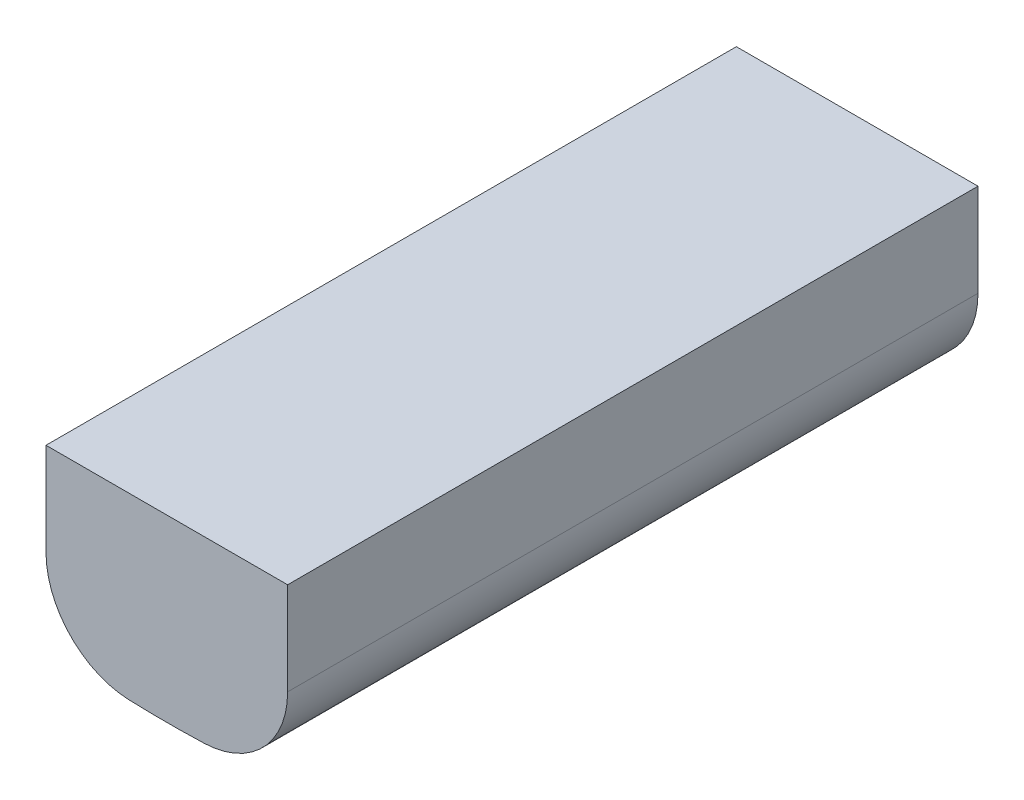
ISO-10303-21;
HEADER;
FILE_DESCRIPTION(('STEP AP214'),'2;1');
FILE_NAME('part.step','',(''),(''),'','','');
FILE_SCHEMA(('AUTOMOTIVE_DESIGN { 1 0 10303 214 1 1 1 1 }'));
ENDSEC;
DATA;
#1=APPLICATION_CONTEXT('core data for automotive mechanical design processes');
#2=APPLICATION_PROTOCOL_DEFINITION('international standard','automotive_design',2000,#1);
#3=PRODUCT_CONTEXT('',#1,'mechanical');
#4=PRODUCT('Part','Part','',(#3));
#5=PRODUCT_RELATED_PRODUCT_CATEGORY('part','',(#4));
#6=PRODUCT_DEFINITION_FORMATION('','',#4);
#7=PRODUCT_DEFINITION_CONTEXT('part definition',#1,'design');
#8=PRODUCT_DEFINITION('design','',#6,#7);
#9=PRODUCT_DEFINITION_SHAPE('','',#8);
#10=(LENGTH_UNIT() NAMED_UNIT(*) SI_UNIT(.MILLI.,.METRE.));
#11=(NAMED_UNIT(*) PLANE_ANGLE_UNIT() SI_UNIT($,.RADIAN.));
#12=(NAMED_UNIT(*) SI_UNIT($,.STERADIAN.) SOLID_ANGLE_UNIT());
#13=UNCERTAINTY_MEASURE_WITH_UNIT(LENGTH_MEASURE(1.E-05),#10,'distance_accuracy_value','');
#14=(GEOMETRIC_REPRESENTATION_CONTEXT(3) GLOBAL_UNCERTAINTY_ASSIGNED_CONTEXT((#13)) GLOBAL_UNIT_ASSIGNED_CONTEXT((#10,
#11,#12)) REPRESENTATION_CONTEXT('',''));
#15=CARTESIAN_POINT('',(0.,0.,0.));
#16=DIRECTION('',(0.,0.,1.));
#17=DIRECTION('',(1.,0.,0.));
#18=AXIS2_PLACEMENT_3D('',#15,#16,#17);
#19=CARTESIAN_POINT('',(0.05,-1.37409060836613,1.));
#20=DIRECTION('',(0.,0.,-1.));
#21=DIRECTION('',(-1.,0.,0.));
#22=AXIS2_PLACEMENT_3D('',#19,#20,#21);
#23=CYLINDRICAL_SURFACE('',#22,0.125);
#24=CARTESIAN_POINT('',(0.05,-1.37409060836613,0.));
#25=DIRECTION('',(0.,0.,1.));
#26=DIRECTION('',(-1.,0.,0.));
#27=AXIS2_PLACEMENT_3D('',#24,#25,#26);
#28=CIRCLE('',#27,0.125);
#29=CARTESIAN_POINT('',(0.0545454545454544,-1.49900793639941,0.));
#30=VERTEX_POINT('',#29);
#31=CARTESIAN_POINT('',(0.175,-1.37409060836613,0.));
#32=VERTEX_POINT('',#31);
#33=EDGE_CURVE('E121',#30,#32,#28,.T.);
#34=ORIENTED_EDGE('',*,*,#33,.T.);
#35=DIRECTION('',(0.,0.,-1.));
#36=VECTOR('',#35,1.);
#37=CARTESIAN_POINT('',(0.175,-1.37409060836613,1.));
#38=LINE('',#37,#36);
#39=CARTESIAN_POINT('',(0.175,-1.37409060836613,1.));
#40=VERTEX_POINT('',#39);
#41=EDGE_CURVE('E11',#40,#32,#38,.T.);
#42=ORIENTED_EDGE('',*,*,#41,.F.);
#43=CARTESIAN_POINT('',(0.05,-1.37409060836613,1.));
#44=DIRECTION('',(0.,0.,1.));
#45=DIRECTION('',(-1.,0.,0.));
#46=AXIS2_PLACEMENT_3D('',#43,#44,#45);
#47=CIRCLE('',#46,0.125);
#48=CARTESIAN_POINT('',(0.0545454545454544,-1.49900793639941,1.));
#49=VERTEX_POINT('',#48);
#50=EDGE_CURVE('E131',#49,#40,#47,.T.);
#51=ORIENTED_EDGE('',*,*,#50,.F.);
#52=DIRECTION('',(0.,0.,-1.));
#53=VECTOR('',#52,1.);
#54=CARTESIAN_POINT('',(0.0545454545454544,-1.49900793639941,1.));
#55=LINE('',#54,#53);
#56=EDGE_CURVE('E117',#49,#30,#55,.T.);
#57=ORIENTED_EDGE('',*,*,#56,.T.);
#58=EDGE_LOOP('',(#34,#42,#51,#57));
#59=FACE_BOUND('',#58,.T.);
#60=ADVANCED_FACE('F37',(#59),#23,.T.);
#61=CARTESIAN_POINT('',(0.175,-1.23975669154396,1.));
#62=DIRECTION('',(-1.,0.,0.));
#63=DIRECTION('',(0.,-1.,0.));
#64=AXIS2_PLACEMENT_3D('',#61,#62,#63);
#65=PLANE('',#64);
#66=DIRECTION('',(0.,1.,0.));
#67=VECTOR('',#66,1.);
#68=CARTESIAN_POINT('',(0.175,-1.23975669154396,0.));
#69=LINE('',#68,#67);
#70=CARTESIAN_POINT('',(0.175,-1.23975669154396,0.));
#71=VERTEX_POINT('',#70);
#72=EDGE_CURVE('E124',#32,#71,#69,.T.);
#73=ORIENTED_EDGE('',*,*,#72,.T.);
#74=DIRECTION('',(0.,0.,-1.));
#75=VECTOR('',#74,1.);
#76=CARTESIAN_POINT('',(0.175,-1.23975669154396,1.));
#77=LINE('',#76,#75);
#78=CARTESIAN_POINT('',(0.175,-1.23975669154396,1.));
#79=VERTEX_POINT('',#78);
#80=EDGE_CURVE('E45',#79,#71,#77,.T.);
#81=ORIENTED_EDGE('',*,*,#80,.F.);
#82=DIRECTION('',(0.,1.,0.));
#83=VECTOR('',#82,1.);
#84=CARTESIAN_POINT('',(0.175,-1.23975669154396,1.));
#85=LINE('',#84,#83);
#86=EDGE_CURVE('E90',#40,#79,#85,.T.);
#87=ORIENTED_EDGE('',*,*,#86,.F.);
#88=ORIENTED_EDGE('',*,*,#41,.T.);
#89=EDGE_LOOP('',(#73,#81,#87,#88));
#90=FACE_BOUND('',#89,.T.);
#91=ADVANCED_FACE('F155',(#90),#65,.F.);
#92=CARTESIAN_POINT('',(-0.175,-1.23975669154396,1.));
#93=DIRECTION('',(0.,-1.,0.));
#94=DIRECTION('',(1.,0.,0.));
#95=AXIS2_PLACEMENT_3D('',#92,#93,#94);
#96=PLANE('',#95);
#97=DIRECTION('',(-1.,0.,0.));
#98=VECTOR('',#97,1.);
#99=CARTESIAN_POINT('',(-0.175,-1.23975669154396,0.));
#100=LINE('',#99,#98);
#101=CARTESIAN_POINT('',(-0.175,-1.23975669154396,0.));
#102=VERTEX_POINT('',#101);
#103=EDGE_CURVE('E126',#71,#102,#100,.T.);
#104=ORIENTED_EDGE('',*,*,#103,.T.);
#105=DIRECTION('',(0.,0.,-1.));
#106=VECTOR('',#105,1.);
#107=CARTESIAN_POINT('',(-0.175,-1.23975669154396,1.));
#108=LINE('',#107,#106);
#109=CARTESIAN_POINT('',(-0.175,-1.23975669154396,1.));
#110=VERTEX_POINT('',#109);
#111=EDGE_CURVE('E112',#110,#102,#108,.T.);
#112=ORIENTED_EDGE('',*,*,#111,.F.);
#113=DIRECTION('',(-1.,0.,0.));
#114=VECTOR('',#113,1.);
#115=CARTESIAN_POINT('',(-0.175,-1.23975669154396,1.));
#116=LINE('',#115,#114);
#117=EDGE_CURVE('E103',#79,#110,#116,.T.);
#118=ORIENTED_EDGE('',*,*,#117,.F.);
#119=ORIENTED_EDGE('',*,*,#80,.T.);
#120=EDGE_LOOP('',(#104,#112,#118,#119));
#121=FACE_BOUND('',#120,.T.);
#122=ADVANCED_FACE('F137',(#121),#96,.F.);
#123=CARTESIAN_POINT('',(-0.175,-1.23975669154396,1.));
#124=DIRECTION('',(1.,0.,0.));
#125=DIRECTION('',(0.,1.,0.));
#126=AXIS2_PLACEMENT_3D('',#123,#124,#125);
#127=PLANE('',#126);
#128=DIRECTION('',(0.,-1.,0.));
#129=VECTOR('',#128,1.);
#130=CARTESIAN_POINT('',(-0.175,-1.23975669154396,0.));
#131=LINE('',#130,#129);
#132=CARTESIAN_POINT('',(-0.175,-1.37409060836613,0.));
#133=VERTEX_POINT('',#132);
#134=EDGE_CURVE('E111',#102,#133,#131,.T.);
#135=ORIENTED_EDGE('',*,*,#134,.T.);
#136=DIRECTION('',(0.,0.,-1.));
#137=VECTOR('',#136,1.);
#138=CARTESIAN_POINT('',(-0.175,-1.37409060836613,1.));
#139=LINE('',#138,#137);
#140=CARTESIAN_POINT('',(-0.175,-1.37409060836613,1.));
#141=VERTEX_POINT('',#140);
#142=EDGE_CURVE('E108',#141,#133,#139,.T.);
#143=ORIENTED_EDGE('',*,*,#142,.F.);
#144=DIRECTION('',(0.,-1.,0.));
#145=VECTOR('',#144,1.);
#146=CARTESIAN_POINT('',(-0.175,-1.23975669154396,1.));
#147=LINE('',#146,#145);
#148=EDGE_CURVE('E97',#110,#141,#147,.T.);
#149=ORIENTED_EDGE('',*,*,#148,.F.);
#150=ORIENTED_EDGE('',*,*,#111,.T.);
#151=EDGE_LOOP('',(#135,#143,#149,#150));
#152=FACE_BOUND('',#151,.T.);
#153=ADVANCED_FACE('F109',(#152),#127,.F.);
#154=CARTESIAN_POINT('',(-0.05,-1.37409060836613,1.));
#155=DIRECTION('',(0.,0.,-1.));
#156=DIRECTION('',(-1.,0.,0.));
#157=AXIS2_PLACEMENT_3D('',#154,#155,#156);
#158=CYLINDRICAL_SURFACE('',#157,0.125);
#159=CARTESIAN_POINT('',(-0.05,-1.37409060836613,0.));
#160=DIRECTION('',(0.,0.,1.));
#161=DIRECTION('',(1.,0.,0.));
#162=AXIS2_PLACEMENT_3D('',#159,#160,#161);
#163=CIRCLE('',#162,0.125);
#164=CARTESIAN_POINT('',(-0.0545454545454546,-1.49900793639941,0.));
#165=VERTEX_POINT('',#164);
#166=EDGE_CURVE('E76',#133,#165,#163,.T.);
#167=ORIENTED_EDGE('',*,*,#166,.T.);
#168=DIRECTION('',(0.,0.,-1.));
#169=VECTOR('',#168,1.);
#170=CARTESIAN_POINT('',(-0.0545454545454546,-1.49900793639941,1.));
#171=LINE('',#170,#169);
#172=CARTESIAN_POINT('',(-0.0545454545454546,-1.49900793639941,1.));
#173=VERTEX_POINT('',#172);
#174=EDGE_CURVE('E113',#173,#165,#171,.T.);
#175=ORIENTED_EDGE('',*,*,#174,.F.);
#176=CARTESIAN_POINT('',(-0.05,-1.37409060836613,1.));
#177=DIRECTION('',(0.,0.,1.));
#178=DIRECTION('',(1.,0.,0.));
#179=AXIS2_PLACEMENT_3D('',#176,#177,#178);
#180=CIRCLE('',#179,0.125);
#181=EDGE_CURVE('E101',#141,#173,#180,.T.);
#182=ORIENTED_EDGE('',*,*,#181,.F.);
#183=ORIENTED_EDGE('',*,*,#142,.T.);
#184=EDGE_LOOP('',(#167,#175,#182,#183));
#185=FACE_BOUND('',#184,.T.);
#186=ADVANCED_FACE('F115',(#185),#158,.T.);
#187=CARTESIAN_POINT('',(0.,0.,1.));
#188=DIRECTION('',(0.,0.,-1.));
#189=DIRECTION('',(-1.,0.,0.));
#190=AXIS2_PLACEMENT_3D('',#187,#188,#189);
#191=CYLINDRICAL_SURFACE('',#190,1.5);
#192=CARTESIAN_POINT('',(0.,0.,0.));
#193=DIRECTION('',(0.,0.,1.));
#194=DIRECTION('',(1.,0.,0.));
#195=AXIS2_PLACEMENT_3D('',#192,#193,#194);
#196=CIRCLE('',#195,1.5);
#197=EDGE_CURVE('E82',#165,#30,#196,.T.);
#198=ORIENTED_EDGE('',*,*,#197,.T.);
#199=ORIENTED_EDGE('',*,*,#56,.F.);
#200=CARTESIAN_POINT('',(0.,0.,1.));
#201=DIRECTION('',(0.,0.,1.));
#202=DIRECTION('',(1.,0.,0.));
#203=AXIS2_PLACEMENT_3D('',#200,#201,#202);
#204=CIRCLE('',#203,1.5);
#205=EDGE_CURVE('E53',#173,#49,#204,.T.);
#206=ORIENTED_EDGE('',*,*,#205,.F.);
#207=ORIENTED_EDGE('',*,*,#174,.T.);
#208=EDGE_LOOP('',(#198,#199,#206,#207));
#209=FACE_BOUND('',#208,.T.);
#210=ADVANCED_FACE('F144',(#209),#191,.T.);
#211=CARTESIAN_POINT('',(0.05,-1.37409060836613,1.));
#212=DIRECTION('',(0.,0.,-1.));
#213=DIRECTION('',(-1.,0.,0.));
#214=AXIS2_PLACEMENT_3D('',#211,#212,#213);
#215=PLANE('',#214);
#216=ORIENTED_EDGE('',*,*,#50,.T.);
#217=ORIENTED_EDGE('',*,*,#86,.T.);
#218=ORIENTED_EDGE('',*,*,#117,.T.);
#219=ORIENTED_EDGE('',*,*,#148,.T.);
#220=ORIENTED_EDGE('',*,*,#181,.T.);
#221=ORIENTED_EDGE('',*,*,#205,.T.);
#222=EDGE_LOOP('',(#216,#217,#218,#219,#220,#221));
#223=FACE_BOUND('',#222,.T.);
#224=ADVANCED_FACE('F99',(#223),#215,.F.);
#225=CARTESIAN_POINT('',(0.05,-1.37409060836613,0.));
#226=DIRECTION('',(0.,0.,-1.));
#227=DIRECTION('',(-1.,0.,0.));
#228=AXIS2_PLACEMENT_3D('',#225,#226,#227);
#229=PLANE('',#228);
#230=ORIENTED_EDGE('',*,*,#33,.F.);
#231=ORIENTED_EDGE('',*,*,#197,.F.);
#232=ORIENTED_EDGE('',*,*,#166,.F.);
#233=ORIENTED_EDGE('',*,*,#134,.F.);
#234=ORIENTED_EDGE('',*,*,#103,.F.);
#235=ORIENTED_EDGE('',*,*,#72,.F.);
#236=EDGE_LOOP('',(#230,#231,#232,#233,#234,#235));
#237=FACE_BOUND('',#236,.T.);
#238=ADVANCED_FACE('F140',(#237),#229,.T.);
#239=CLOSED_SHELL('',(#60,#91,#122,#153,#186,#210,#224,#238));
#240=MANIFOLD_SOLID_BREP('B2',#239);
#241=ADVANCED_BREP_SHAPE_REPRESENTATION('',(#18,#240),#14);
#242=SHAPE_DEFINITION_REPRESENTATION(#9,#241);
ENDSEC;
END-ISO-10303-21;
